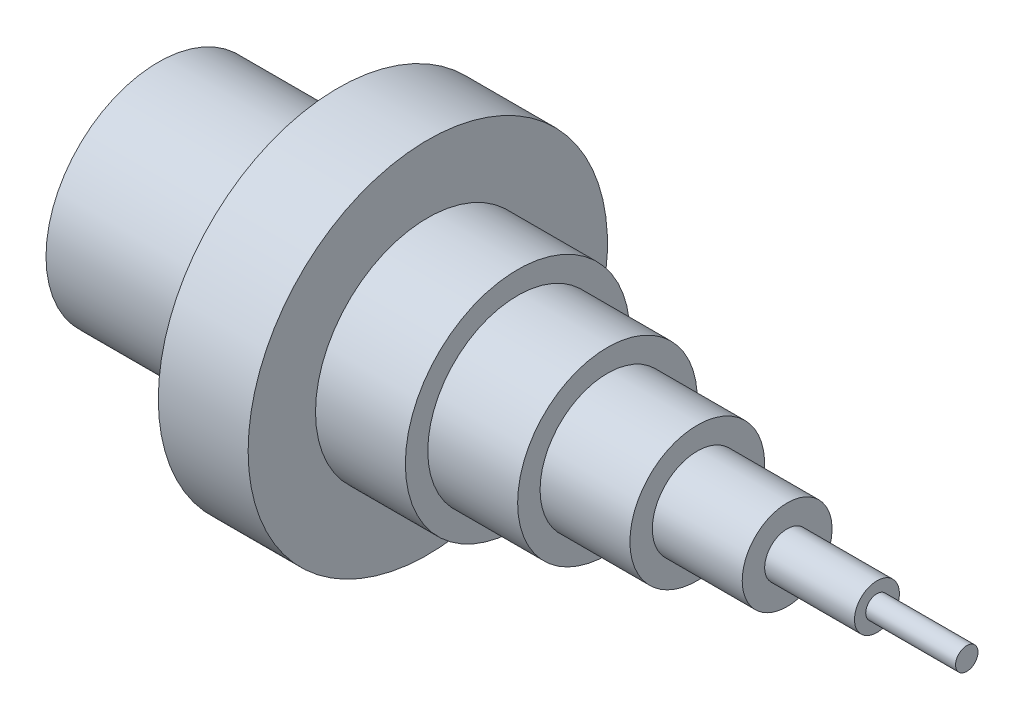
ISO-10303-21;
HEADER;
FILE_DESCRIPTION(('STEP AP214'),'2;1');
FILE_NAME('part.step','',(''),(''),'','','');
FILE_SCHEMA(('AUTOMOTIVE_DESIGN { 1 0 10303 214 1 1 1 1 }'));
ENDSEC;
DATA;
#1=APPLICATION_CONTEXT('core data for automotive mechanical design processes');
#2=APPLICATION_PROTOCOL_DEFINITION('international standard','automotive_design',2000,#1);
#3=PRODUCT_CONTEXT('',#1,'mechanical');
#4=PRODUCT('Part','Part','',(#3));
#5=PRODUCT_RELATED_PRODUCT_CATEGORY('part','',(#4));
#6=PRODUCT_DEFINITION_FORMATION('','',#4);
#7=PRODUCT_DEFINITION_CONTEXT('part definition',#1,'design');
#8=PRODUCT_DEFINITION('design','',#6,#7);
#9=PRODUCT_DEFINITION_SHAPE('','',#8);
#10=(LENGTH_UNIT() NAMED_UNIT(*) SI_UNIT(.MILLI.,.METRE.));
#11=(NAMED_UNIT(*) PLANE_ANGLE_UNIT() SI_UNIT($,.RADIAN.));
#12=(NAMED_UNIT(*) SI_UNIT($,.STERADIAN.) SOLID_ANGLE_UNIT());
#13=UNCERTAINTY_MEASURE_WITH_UNIT(LENGTH_MEASURE(1.E-05),#10,'distance_accuracy_value','');
#14=(GEOMETRIC_REPRESENTATION_CONTEXT(3) GLOBAL_UNCERTAINTY_ASSIGNED_CONTEXT((#13)) GLOBAL_UNIT_ASSIGNED_CONTEXT((#10,
#11,#12)) REPRESENTATION_CONTEXT('',''));
#15=CARTESIAN_POINT('',(0.,0.,0.));
#16=DIRECTION('',(0.,0.,1.));
#17=DIRECTION('',(1.,0.,0.));
#18=AXIS2_PLACEMENT_3D('',#15,#16,#17);
#19=CARTESIAN_POINT('',(4572.,0.,0.));
#20=DIRECTION('',(1.,0.,0.));
#21=DIRECTION('',(0.,0.,-1.));
#22=AXIS2_PLACEMENT_3D('',#19,#20,#21);
#23=PLANE('',#22);
#24=CARTESIAN_POINT('',(4572.,0.,0.));
#25=DIRECTION('',(-1.,0.,0.));
#26=DIRECTION('',(0.,0.,1.));
#27=AXIS2_PLACEMENT_3D('',#24,#25,#26);
#28=CIRCLE('',#27,63.5);
#29=CARTESIAN_POINT('',(4572.,0.,63.5));
#30=VERTEX_POINT('',#29);
#31=EDGE_CURVE('E10',#30,#30,#28,.T.);
#32=ORIENTED_EDGE('',*,*,#31,.F.);
#33=EDGE_LOOP('',(#32));
#34=FACE_BOUND('',#33,.T.);
#35=ADVANCED_FACE('F31',(#34),#23,.T.);
#36=CARTESIAN_POINT('',(0.,0.,0.));
#37=DIRECTION('',(-1.,0.,0.));
#38=DIRECTION('',(0.,0.,1.));
#39=AXIS2_PLACEMENT_3D('',#36,#37,#38);
#40=CYLINDRICAL_SURFACE('',#39,63.5);
#41=ORIENTED_EDGE('',*,*,#31,.T.);
#42=EDGE_LOOP('',(#41));
#43=FACE_BOUND('',#42,.T.);
#44=CARTESIAN_POINT('',(4064.,0.,0.));
#45=DIRECTION('',(-1.,0.,0.));
#46=DIRECTION('',(0.,0.,1.));
#47=AXIS2_PLACEMENT_3D('',#44,#45,#46);
#48=CIRCLE('',#47,63.5);
#49=CARTESIAN_POINT('',(4064.,0.,63.5));
#50=VERTEX_POINT('',#49);
#51=EDGE_CURVE('E37',#50,#50,#48,.T.);
#52=ORIENTED_EDGE('',*,*,#51,.F.);
#53=EDGE_LOOP('',(#52));
#54=FACE_BOUND('',#53,.T.);
#55=ADVANCED_FACE('F119',(#43,#54),#40,.T.);
#56=CARTESIAN_POINT('',(4064.,-63.5,0.));
#57=DIRECTION('',(1.,0.,0.));
#58=DIRECTION('',(0.,0.,-1.));
#59=AXIS2_PLACEMENT_3D('',#56,#57,#58);
#60=PLANE('',#59);
#61=ORIENTED_EDGE('',*,*,#51,.T.);
#62=EDGE_LOOP('',(#61));
#63=FACE_BOUND('',#62,.T.);
#64=CARTESIAN_POINT('',(4064.,0.,0.));
#65=DIRECTION('',(-1.,0.,0.));
#66=DIRECTION('',(0.,0.,1.));
#67=AXIS2_PLACEMENT_3D('',#64,#65,#66);
#68=CIRCLE('',#67,127.);
#69=CARTESIAN_POINT('',(4064.,0.,127.));
#70=VERTEX_POINT('',#69);
#71=EDGE_CURVE('E41',#70,#70,#68,.T.);
#72=ORIENTED_EDGE('',*,*,#71,.F.);
#73=EDGE_LOOP('',(#72));
#74=FACE_BOUND('',#73,.T.);
#75=ADVANCED_FACE('F124',(#63,#74),#60,.T.);
#76=CARTESIAN_POINT('',(0.,0.,0.));
#77=DIRECTION('',(-1.,0.,0.));
#78=DIRECTION('',(0.,0.,1.));
#79=AXIS2_PLACEMENT_3D('',#76,#77,#78);
#80=CYLINDRICAL_SURFACE('',#79,127.);
#81=ORIENTED_EDGE('',*,*,#71,.T.);
#82=EDGE_LOOP('',(#81));
#83=FACE_BOUND('',#82,.T.);
#84=CARTESIAN_POINT('',(3556.,0.,0.));
#85=DIRECTION('',(-1.,0.,0.));
#86=DIRECTION('',(0.,0.,1.));
#87=AXIS2_PLACEMENT_3D('',#84,#85,#86);
#88=CIRCLE('',#87,127.);
#89=CARTESIAN_POINT('',(3556.,0.,127.));
#90=VERTEX_POINT('',#89);
#91=EDGE_CURVE('E45',#90,#90,#88,.T.);
#92=ORIENTED_EDGE('',*,*,#91,.F.);
#93=EDGE_LOOP('',(#92));
#94=FACE_BOUND('',#93,.T.);
#95=ADVANCED_FACE('F128',(#83,#94),#80,.T.);
#96=CARTESIAN_POINT('',(3556.,-127.,0.));
#97=DIRECTION('',(1.,0.,0.));
#98=DIRECTION('',(0.,0.,-1.));
#99=AXIS2_PLACEMENT_3D('',#96,#97,#98);
#100=PLANE('',#99);
#101=ORIENTED_EDGE('',*,*,#91,.T.);
#102=EDGE_LOOP('',(#101));
#103=FACE_BOUND('',#102,.T.);
#104=CARTESIAN_POINT('',(3556.,0.,0.));
#105=DIRECTION('',(-1.,0.,0.));
#106=DIRECTION('',(0.,0.,1.));
#107=AXIS2_PLACEMENT_3D('',#104,#105,#106);
#108=CIRCLE('',#107,254.);
#109=CARTESIAN_POINT('',(3556.,0.,254.));
#110=VERTEX_POINT('',#109);
#111=EDGE_CURVE('E50',#110,#110,#108,.T.);
#112=ORIENTED_EDGE('',*,*,#111,.F.);
#113=EDGE_LOOP('',(#112));
#114=FACE_BOUND('',#113,.T.);
#115=ADVANCED_FACE('F134',(#103,#114),#100,.T.);
#116=CARTESIAN_POINT('',(0.,0.,0.));
#117=DIRECTION('',(-1.,0.,0.));
#118=DIRECTION('',(0.,0.,1.));
#119=AXIS2_PLACEMENT_3D('',#116,#117,#118);
#120=CYLINDRICAL_SURFACE('',#119,254.);
#121=ORIENTED_EDGE('',*,*,#111,.T.);
#122=EDGE_LOOP('',(#121));
#123=FACE_BOUND('',#122,.T.);
#124=CARTESIAN_POINT('',(3048.,0.,0.));
#125=DIRECTION('',(-1.,0.,0.));
#126=DIRECTION('',(0.,0.,1.));
#127=AXIS2_PLACEMENT_3D('',#124,#125,#126);
#128=CIRCLE('',#127,254.);
#129=CARTESIAN_POINT('',(3048.,0.,254.));
#130=VERTEX_POINT('',#129);
#131=EDGE_CURVE('E53',#130,#130,#128,.T.);
#132=ORIENTED_EDGE('',*,*,#131,.F.);
#133=EDGE_LOOP('',(#132));
#134=FACE_BOUND('',#133,.T.);
#135=ADVANCED_FACE('F138',(#123,#134),#120,.T.);
#136=CARTESIAN_POINT('',(3048.,-254.,0.));
#137=DIRECTION('',(1.,0.,0.));
#138=DIRECTION('',(0.,0.,-1.));
#139=AXIS2_PLACEMENT_3D('',#136,#137,#138);
#140=PLANE('',#139);
#141=ORIENTED_EDGE('',*,*,#131,.T.);
#142=EDGE_LOOP('',(#141));
#143=FACE_BOUND('',#142,.T.);
#144=CARTESIAN_POINT('',(3048.,0.,0.));
#145=DIRECTION('',(-1.,0.,0.));
#146=DIRECTION('',(0.,0.,1.));
#147=AXIS2_PLACEMENT_3D('',#144,#145,#146);
#148=CIRCLE('',#147,381.);
#149=CARTESIAN_POINT('',(3048.,0.,381.));
#150=VERTEX_POINT('',#149);
#151=EDGE_CURVE('E56',#150,#150,#148,.T.);
#152=ORIENTED_EDGE('',*,*,#151,.F.);
#153=EDGE_LOOP('',(#152));
#154=FACE_BOUND('',#153,.T.);
#155=ADVANCED_FACE('F142',(#143,#154),#140,.T.);
#156=CARTESIAN_POINT('',(0.,0.,0.));
#157=DIRECTION('',(-1.,0.,0.));
#158=DIRECTION('',(0.,0.,1.));
#159=AXIS2_PLACEMENT_3D('',#156,#157,#158);
#160=CYLINDRICAL_SURFACE('',#159,381.);
#161=ORIENTED_EDGE('',*,*,#151,.T.);
#162=EDGE_LOOP('',(#161));
#163=FACE_BOUND('',#162,.T.);
#164=CARTESIAN_POINT('',(2540.,0.,0.));
#165=DIRECTION('',(-1.,0.,0.));
#166=DIRECTION('',(0.,0.,1.));
#167=AXIS2_PLACEMENT_3D('',#164,#165,#166);
#168=CIRCLE('',#167,381.);
#169=CARTESIAN_POINT('',(2540.,0.,381.));
#170=VERTEX_POINT('',#169);
#171=EDGE_CURVE('E59',#170,#170,#168,.T.);
#172=ORIENTED_EDGE('',*,*,#171,.F.);
#173=EDGE_LOOP('',(#172));
#174=FACE_BOUND('',#173,.T.);
#175=ADVANCED_FACE('F146',(#163,#174),#160,.T.);
#176=CARTESIAN_POINT('',(2540.,-381.,0.));
#177=DIRECTION('',(1.,0.,0.));
#178=DIRECTION('',(0.,0.,-1.));
#179=AXIS2_PLACEMENT_3D('',#176,#177,#178);
#180=PLANE('',#179);
#181=ORIENTED_EDGE('',*,*,#171,.T.);
#182=EDGE_LOOP('',(#181));
#183=FACE_BOUND('',#182,.T.);
#184=CARTESIAN_POINT('',(2540.,0.,0.));
#185=DIRECTION('',(-1.,0.,0.));
#186=DIRECTION('',(0.,0.,1.));
#187=AXIS2_PLACEMENT_3D('',#184,#185,#186);
#188=CIRCLE('',#187,508.);
#189=CARTESIAN_POINT('',(2540.,0.,508.));
#190=VERTEX_POINT('',#189);
#191=EDGE_CURVE('E62',#190,#190,#188,.T.);
#192=ORIENTED_EDGE('',*,*,#191,.F.);
#193=EDGE_LOOP('',(#192));
#194=FACE_BOUND('',#193,.T.);
#195=ADVANCED_FACE('F150',(#183,#194),#180,.T.);
#196=CARTESIAN_POINT('',(0.,0.,0.));
#197=DIRECTION('',(-1.,0.,0.));
#198=DIRECTION('',(0.,0.,1.));
#199=AXIS2_PLACEMENT_3D('',#196,#197,#198);
#200=CYLINDRICAL_SURFACE('',#199,508.);
#201=ORIENTED_EDGE('',*,*,#191,.T.);
#202=EDGE_LOOP('',(#201));
#203=FACE_BOUND('',#202,.T.);
#204=CARTESIAN_POINT('',(2032.,0.,0.));
#205=DIRECTION('',(-1.,0.,0.));
#206=DIRECTION('',(0.,0.,1.));
#207=AXIS2_PLACEMENT_3D('',#204,#205,#206);
#208=CIRCLE('',#207,508.);
#209=CARTESIAN_POINT('',(2032.,0.,508.));
#210=VERTEX_POINT('',#209);
#211=EDGE_CURVE('E65',#210,#210,#208,.T.);
#212=ORIENTED_EDGE('',*,*,#211,.F.);
#213=EDGE_LOOP('',(#212));
#214=FACE_BOUND('',#213,.T.);
#215=ADVANCED_FACE('F154',(#203,#214),#200,.T.);
#216=CARTESIAN_POINT('',(2032.,-508.,0.));
#217=DIRECTION('',(1.,0.,0.));
#218=DIRECTION('',(0.,0.,-1.));
#219=AXIS2_PLACEMENT_3D('',#216,#217,#218);
#220=PLANE('',#219);
#221=ORIENTED_EDGE('',*,*,#211,.T.);
#222=EDGE_LOOP('',(#221));
#223=FACE_BOUND('',#222,.T.);
#224=CARTESIAN_POINT('',(2032.,0.,0.));
#225=DIRECTION('',(-1.,0.,0.));
#226=DIRECTION('',(0.,0.,1.));
#227=AXIS2_PLACEMENT_3D('',#224,#225,#226);
#228=CIRCLE('',#227,635.);
#229=CARTESIAN_POINT('',(2032.,0.,635.));
#230=VERTEX_POINT('',#229);
#231=EDGE_CURVE('E68',#230,#230,#228,.T.);
#232=ORIENTED_EDGE('',*,*,#231,.F.);
#233=EDGE_LOOP('',(#232));
#234=FACE_BOUND('',#233,.T.);
#235=ADVANCED_FACE('F158',(#223,#234),#220,.T.);
#236=CARTESIAN_POINT('',(0.,0.,0.));
#237=DIRECTION('',(-1.,0.,0.));
#238=DIRECTION('',(0.,0.,1.));
#239=AXIS2_PLACEMENT_3D('',#236,#237,#238);
#240=CYLINDRICAL_SURFACE('',#239,635.);
#241=ORIENTED_EDGE('',*,*,#231,.T.);
#242=EDGE_LOOP('',(#241));
#243=FACE_BOUND('',#242,.T.);
#244=CARTESIAN_POINT('',(1524.,0.,0.));
#245=DIRECTION('',(-1.,0.,0.));
#246=DIRECTION('',(0.,0.,1.));
#247=AXIS2_PLACEMENT_3D('',#244,#245,#246);
#248=CIRCLE('',#247,635.);
#249=CARTESIAN_POINT('',(1524.,0.,635.));
#250=VERTEX_POINT('',#249);
#251=EDGE_CURVE('E71',#250,#250,#248,.T.);
#252=ORIENTED_EDGE('',*,*,#251,.F.);
#253=EDGE_LOOP('',(#252));
#254=FACE_BOUND('',#253,.T.);
#255=ADVANCED_FACE('F162',(#243,#254),#240,.T.);
#256=CARTESIAN_POINT('',(1524.,-1016.,0.));
#257=DIRECTION('',(1.,0.,0.));
#258=DIRECTION('',(0.,0.,-1.));
#259=AXIS2_PLACEMENT_3D('',#256,#257,#258);
#260=PLANE('',#259);
#261=ORIENTED_EDGE('',*,*,#251,.T.);
#262=EDGE_LOOP('',(#261));
#263=FACE_BOUND('',#262,.T.);
#264=CARTESIAN_POINT('',(1524.,0.,0.));
#265=DIRECTION('',(-1.,0.,0.));
#266=DIRECTION('',(0.,0.,1.));
#267=AXIS2_PLACEMENT_3D('',#264,#265,#266);
#268=CIRCLE('',#267,1016.);
#269=CARTESIAN_POINT('',(1524.,0.,1016.));
#270=VERTEX_POINT('',#269);
#271=EDGE_CURVE('E74',#270,#270,#268,.T.);
#272=ORIENTED_EDGE('',*,*,#271,.F.);
#273=EDGE_LOOP('',(#272));
#274=FACE_BOUND('',#273,.T.);
#275=ADVANCED_FACE('F166',(#263,#274),#260,.T.);
#276=CARTESIAN_POINT('',(0.,0.,0.));
#277=DIRECTION('',(-1.,0.,0.));
#278=DIRECTION('',(0.,0.,1.));
#279=AXIS2_PLACEMENT_3D('',#276,#277,#278);
#280=CYLINDRICAL_SURFACE('',#279,1016.);
#281=ORIENTED_EDGE('',*,*,#271,.T.);
#282=EDGE_LOOP('',(#281));
#283=FACE_BOUND('',#282,.T.);
#284=CARTESIAN_POINT('',(1016.,0.,0.));
#285=DIRECTION('',(-1.,0.,0.));
#286=DIRECTION('',(0.,0.,1.));
#287=AXIS2_PLACEMENT_3D('',#284,#285,#286);
#288=CIRCLE('',#287,1016.);
#289=CARTESIAN_POINT('',(1016.,0.,1016.));
#290=VERTEX_POINT('',#289);
#291=EDGE_CURVE('E77',#290,#290,#288,.T.);
#292=ORIENTED_EDGE('',*,*,#291,.F.);
#293=EDGE_LOOP('',(#292));
#294=FACE_BOUND('',#293,.T.);
#295=ADVANCED_FACE('F115',(#283,#294),#280,.T.);
#296=CARTESIAN_POINT('',(1016.,-635.,0.));
#297=DIRECTION('',(-1.,0.,0.));
#298=DIRECTION('',(0.,0.,1.));
#299=AXIS2_PLACEMENT_3D('',#296,#297,#298);
#300=PLANE('',#299);
#301=ORIENTED_EDGE('',*,*,#291,.T.);
#302=EDGE_LOOP('',(#301));
#303=FACE_BOUND('',#302,.T.);
#304=CARTESIAN_POINT('',(1016.,0.,0.));
#305=DIRECTION('',(-1.,0.,0.));
#306=DIRECTION('',(0.,0.,1.));
#307=AXIS2_PLACEMENT_3D('',#304,#305,#306);
#308=CIRCLE('',#307,635.);
#309=CARTESIAN_POINT('',(1016.,0.,635.));
#310=VERTEX_POINT('',#309);
#311=EDGE_CURVE('E80',#310,#310,#308,.T.);
#312=ORIENTED_EDGE('',*,*,#311,.F.);
#313=EDGE_LOOP('',(#312));
#314=FACE_BOUND('',#313,.T.);
#315=ADVANCED_FACE('F109',(#303,#314),#300,.T.);
#316=CARTESIAN_POINT('',(0.,0.,0.));
#317=DIRECTION('',(-1.,0.,0.));
#318=DIRECTION('',(0.,0.,1.));
#319=AXIS2_PLACEMENT_3D('',#316,#317,#318);
#320=CYLINDRICAL_SURFACE('',#319,635.);
#321=ORIENTED_EDGE('',*,*,#311,.T.);
#322=EDGE_LOOP('',(#321));
#323=FACE_BOUND('',#322,.T.);
#324=CARTESIAN_POINT('',(0.,0.,0.));
#325=DIRECTION('',(-1.,0.,0.));
#326=DIRECTION('',(0.,0.,1.));
#327=AXIS2_PLACEMENT_3D('',#324,#325,#326);
#328=CIRCLE('',#327,635.);
#329=CARTESIAN_POINT('',(0.,0.,635.));
#330=VERTEX_POINT('',#329);
#331=EDGE_CURVE('E83',#330,#330,#328,.T.);
#332=ORIENTED_EDGE('',*,*,#331,.F.);
#333=EDGE_LOOP('',(#332));
#334=FACE_BOUND('',#333,.T.);
#335=ADVANCED_FACE('F104',(#323,#334),#320,.T.);
#336=CARTESIAN_POINT('',(0.,-635.,0.));
#337=DIRECTION('',(-1.,0.,0.));
#338=DIRECTION('',(0.,0.,1.));
#339=AXIS2_PLACEMENT_3D('',#336,#337,#338);
#340=PLANE('',#339);
#341=CARTESIAN_POINT('',(0.,0.,0.));
#342=DIRECTION('',(-1.,0.,0.));
#343=DIRECTION('',(0.,0.,1.));
#344=AXIS2_PLACEMENT_3D('',#341,#342,#343);
#345=CIRCLE('',#344,508.);
#346=CARTESIAN_POINT('',(0.,0.,508.));
#347=VERTEX_POINT('',#346);
#348=EDGE_CURVE('E87',#347,#347,#345,.T.);
#349=ORIENTED_EDGE('',*,*,#348,.F.);
#350=EDGE_LOOP('',(#349));
#351=FACE_BOUND('',#350,.T.);
#352=ORIENTED_EDGE('',*,*,#331,.T.);
#353=EDGE_LOOP('',(#352));
#354=FACE_BOUND('',#353,.T.);
#355=ADVANCED_FACE('F98',(#351,#354),#340,.T.);
#356=CARTESIAN_POINT('',(1016.,0.,0.));
#357=DIRECTION('',(-1.,0.,0.));
#358=DIRECTION('',(0.,0.,1.));
#359=AXIS2_PLACEMENT_3D('',#356,#357,#358);
#360=CYLINDRICAL_SURFACE('',#359,508.);
#361=CARTESIAN_POINT('',(1016.,0.,0.));
#362=DIRECTION('',(-1.,0.,0.));
#363=DIRECTION('',(0.,0.,1.));
#364=AXIS2_PLACEMENT_3D('',#361,#362,#363);
#365=CIRCLE('',#364,508.);
#366=CARTESIAN_POINT('',(1016.,0.,508.));
#367=VERTEX_POINT('',#366);
#368=EDGE_CURVE('E86',#367,#367,#365,.T.);
#369=ORIENTED_EDGE('',*,*,#368,.F.);
#370=EDGE_LOOP('',(#369));
#371=FACE_BOUND('',#370,.T.);
#372=ORIENTED_EDGE('',*,*,#348,.T.);
#373=EDGE_LOOP('',(#372));
#374=FACE_BOUND('',#373,.T.);
#375=ADVANCED_FACE('F95',(#371,#374),#360,.F.);
#376=CARTESIAN_POINT('',(1016.,0.,0.));
#377=DIRECTION('',(-1.,0.,0.));
#378=DIRECTION('',(0.,0.,1.));
#379=AXIS2_PLACEMENT_3D('',#376,#377,#378);
#380=PLANE('',#379);
#381=ORIENTED_EDGE('',*,*,#368,.T.);
#382=EDGE_LOOP('',(#381));
#383=FACE_BOUND('',#382,.T.);
#384=ADVANCED_FACE('F93',(#383),#380,.T.);
#385=CLOSED_SHELL('',(#35,#55,#75,#95,#115,#135,#155,#175,#195,#215,#235,#255,#275,#295,#315,
#335,#355,#375,#384));
#386=MANIFOLD_SOLID_BREP('B2',#385);
#387=ADVANCED_BREP_SHAPE_REPRESENTATION('',(#18,#386),#14);
#388=SHAPE_DEFINITION_REPRESENTATION(#9,#387);
ENDSEC;
END-ISO-10303-21;
